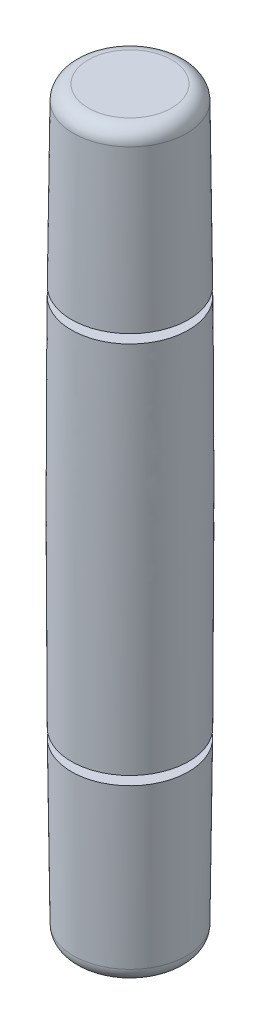
ISO-10303-21;
HEADER;
FILE_DESCRIPTION(('STEP AP214'),'2;1');
FILE_NAME('part.step','',(''),(''),'','','');
FILE_SCHEMA(('AUTOMOTIVE_DESIGN { 1 0 10303 214 1 1 1 1 }'));
ENDSEC;
DATA;
#1=APPLICATION_CONTEXT('core data for automotive mechanical design processes');
#2=APPLICATION_PROTOCOL_DEFINITION('international standard','automotive_design',2000,#1);
#3=PRODUCT_CONTEXT('',#1,'mechanical');
#4=PRODUCT('Part','Part','',(#3));
#5=PRODUCT_RELATED_PRODUCT_CATEGORY('part','',(#4));
#6=PRODUCT_DEFINITION_FORMATION('','',#4);
#7=PRODUCT_DEFINITION_CONTEXT('part definition',#1,'design');
#8=PRODUCT_DEFINITION('design','',#6,#7);
#9=PRODUCT_DEFINITION_SHAPE('','',#8);
#10=(LENGTH_UNIT() NAMED_UNIT(*) SI_UNIT(.MILLI.,.METRE.));
#11=(NAMED_UNIT(*) PLANE_ANGLE_UNIT() SI_UNIT($,.RADIAN.));
#12=(NAMED_UNIT(*) SI_UNIT($,.STERADIAN.) SOLID_ANGLE_UNIT());
#13=UNCERTAINTY_MEASURE_WITH_UNIT(LENGTH_MEASURE(1.E-05),#10,'distance_accuracy_value','');
#14=(GEOMETRIC_REPRESENTATION_CONTEXT(3) GLOBAL_UNCERTAINTY_ASSIGNED_CONTEXT((#13)) GLOBAL_UNIT_ASSIGNED_CONTEXT((#10,
#11,#12)) REPRESENTATION_CONTEXT('',''));
#15=CARTESIAN_POINT('',(0.,0.,0.));
#16=DIRECTION('',(0.,0.,1.));
#17=DIRECTION('',(1.,0.,0.));
#18=AXIS2_PLACEMENT_3D('',#15,#16,#17);
#19=CARTESIAN_POINT('',(1.9,0.,0.));
#20=CARTESIAN_POINT('',(2.1,12.5,0.));
#21=CARTESIAN_POINT('',(1.9,25.,0.));
#22=B_SPLINE_CURVE_WITH_KNOTS('',2,(#19,#20,#21),.UNSPECIFIED.,.F.,.F.,(3,3),(0.,1.),.UNSPECIFIED.);
#23=CARTESIAN_POINT('',(0.,0.,0.));
#24=DIRECTION('',(0.,-1.,0.));
#25=AXIS1_PLACEMENT('',#23,#24);
#26=SURFACE_OF_REVOLUTION('',#22,#25);
#27=CARTESIAN_POINT('',(0.,5.9,0.));
#28=DIRECTION('',(0.,-1.,0.));
#29=DIRECTION('',(0.,0.,-1.));
#30=AXIS2_PLACEMENT_3D('',#27,#28,#29);
#31=CIRCLE('',#30,1.9721216);
#32=CARTESIAN_POINT('',(0.,5.9,-1.9721216));
#33=VERTEX_POINT('',#32);
#34=EDGE_CURVE('E42',#33,#33,#31,.F.);
#35=ORIENTED_EDGE('',*,*,#34,.F.);
#36=EDGE_LOOP('',(#35));
#37=FACE_BOUND('',#36,.T.);
#38=CARTESIAN_POINT('',(0.,0.492315989783819,0.));
#39=DIRECTION('',(0.,-1.,0.));
#40=DIRECTION('',(0.,0.,-1.));
#41=AXIS2_PLACEMENT_3D('',#38,#39,#40);
#42=CIRCLE('',#41,1.90772193581491);
#43=CARTESIAN_POINT('',(0.,0.492315989783819,-1.90772193581491));
#44=VERTEX_POINT('',#43);
#45=EDGE_CURVE('E46',#44,#44,#42,.F.);
#46=ORIENTED_EDGE('',*,*,#45,.T.);
#47=EDGE_LOOP('',(#46));
#48=FACE_BOUND('',#47,.T.);
#49=ADVANCED_FACE('F38',(#37,#48),#26,.F.);
#50=CARTESIAN_POINT('',(0.,0.,0.));
#51=DIRECTION('',(0.,-1.,0.));
#52=DIRECTION('',(0.,0.,-1.));
#53=AXIS2_PLACEMENT_3D('',#50,#51,#52);
#54=PLANE('',#53);
#55=CARTESIAN_POINT('',(0.,0.,0.));
#56=DIRECTION('',(0.,-1.,0.));
#57=DIRECTION('',(0.,0.,-1.));
#58=AXIS2_PLACEMENT_3D('',#55,#56,#57);
#59=CIRCLE('',#58,1.40778098331452);
#60=CARTESIAN_POINT('',(0.,0.,-1.40778098331452));
#61=VERTEX_POINT('',#60);
#62=EDGE_CURVE('E60',#61,#61,#59,.T.);
#63=ORIENTED_EDGE('',*,*,#62,.T.);
#64=EDGE_LOOP('',(#63));
#65=FACE_BOUND('',#64,.T.);
#66=ADVANCED_FACE('F96',(#65),#54,.T.);
#67=CARTESIAN_POINT('',(0.,0.5,0.));
#68=DIRECTION('',(0.,-1.,0.));
#69=DIRECTION('',(0.,0.,-1.));
#70=AXIS2_PLACEMENT_3D('',#67,#68,#69);
#71=TOROIDAL_SURFACE('',#70,1.40778098331452,0.5);
#72=ORIENTED_EDGE('',*,*,#45,.F.);
#73=EDGE_LOOP('',(#72));
#74=FACE_BOUND('',#73,.T.);
#75=ORIENTED_EDGE('',*,*,#62,.F.);
#76=EDGE_LOOP('',(#75));
#77=FACE_BOUND('',#76,.T.);
#78=ADVANCED_FACE('F98',(#74,#77),#71,.T.);
#79=CARTESIAN_POINT('',(0.,0.,0.));
#80=DIRECTION('',(0.,-1.,0.));
#81=DIRECTION('',(0.,0.,-1.));
#82=AXIS2_PLACEMENT_3D('',#79,#80,#81);
#83=CYLINDRICAL_SURFACE('',#82,1.47459948718159);
#84=CARTESIAN_POINT('',(0.,5.9,0.));
#85=DIRECTION('',(0.,-1.,0.));
#86=DIRECTION('',(0.,0.,-1.));
#87=AXIS2_PLACEMENT_3D('',#84,#85,#86);
#88=CIRCLE('',#87,1.4745994871816);
#89=CARTESIAN_POINT('',(0.,5.9,-1.4745994871816));
#90=VERTEX_POINT('',#89);
#91=EDGE_CURVE('E67',#90,#90,#88,.T.);
#92=ORIENTED_EDGE('',*,*,#91,.F.);
#93=EDGE_LOOP('',(#92));
#94=FACE_BOUND('',#93,.T.);
#95=CARTESIAN_POINT('',(0.,6.2,0.));
#96=DIRECTION('',(0.,-1.,0.));
#97=DIRECTION('',(0.,0.,-1.));
#98=AXIS2_PLACEMENT_3D('',#95,#96,#97);
#99=CIRCLE('',#98,1.47459948718159);
#100=CARTESIAN_POINT('',(0.,6.2,-1.47459948718159));
#101=VERTEX_POINT('',#100);
#102=EDGE_CURVE('E56',#101,#101,#99,.T.);
#103=ORIENTED_EDGE('',*,*,#102,.T.);
#104=EDGE_LOOP('',(#103));
#105=FACE_BOUND('',#104,.T.);
#106=ADVANCED_FACE('F101',(#94,#105),#83,.T.);
#107=CARTESIAN_POINT('',(1.97459948718159,6.2,0.));
#108=DIRECTION('',(0.,1.,0.));
#109=DIRECTION('',(0.,0.,1.));
#110=AXIS2_PLACEMENT_3D('',#107,#108,#109);
#111=PLANE('',#110);
#112=ORIENTED_EDGE('',*,*,#102,.F.);
#113=EDGE_LOOP('',(#112));
#114=FACE_BOUND('',#113,.T.);
#115=CARTESIAN_POINT('',(0.,6.2,0.));
#116=DIRECTION('',(0.,-1.,0.));
#117=DIRECTION('',(0.,0.,-1.));
#118=AXIS2_PLACEMENT_3D('',#115,#116,#117);
#119=CIRCLE('',#118,1.97459948718159);
#120=CARTESIAN_POINT('',(0.,6.2,-1.97459948718159));
#121=VERTEX_POINT('',#120);
#122=EDGE_CURVE('E62',#121,#121,#119,.T.);
#123=ORIENTED_EDGE('',*,*,#122,.T.);
#124=EDGE_LOOP('',(#123));
#125=FACE_BOUND('',#124,.T.);
#126=ADVANCED_FACE('F106',(#114,#125),#111,.F.);
#127=CARTESIAN_POINT('',(1.9745994871816,5.9,0.));
#128=DIRECTION('',(0.,-1.,0.));
#129=DIRECTION('',(0.,0.,-1.));
#130=AXIS2_PLACEMENT_3D('',#127,#128,#129);
#131=PLANE('',#130);
#132=ORIENTED_EDGE('',*,*,#34,.T.);
#133=EDGE_LOOP('',(#132));
#134=FACE_BOUND('',#133,.T.);
#135=ORIENTED_EDGE('',*,*,#91,.T.);
#136=EDGE_LOOP('',(#135));
#137=FACE_BOUND('',#136,.T.);
#138=ADVANCED_FACE('F119',(#134,#137),#131,.F.);
#139=ORIENTED_EDGE('',*,*,#122,.F.);
#140=EDGE_LOOP('',(#139));
#141=FACE_BOUND('',#140,.T.);
#142=CARTESIAN_POINT('',(0.,18.8,0.));
#143=DIRECTION('',(0.,-1.,0.));
#144=DIRECTION('',(0.,0.,-1.));
#145=AXIS2_PLACEMENT_3D('',#142,#143,#144);
#146=CIRCLE('',#145,1.97459948718159);
#147=CARTESIAN_POINT('',(0.,18.8,-1.97459948718159));
#148=VERTEX_POINT('',#147);
#149=EDGE_CURVE('E71',#148,#148,#146,.T.);
#150=ORIENTED_EDGE('',*,*,#149,.T.);
#151=EDGE_LOOP('',(#150));
#152=FACE_BOUND('',#151,.T.);
#153=ADVANCED_FACE('F93',(#141,#152),#26,.F.);
#154=CARTESIAN_POINT('',(1.97459948718159,18.8,0.));
#155=DIRECTION('',(0.,-1.,0.));
#156=DIRECTION('',(0.,0.,-1.));
#157=AXIS2_PLACEMENT_3D('',#154,#155,#156);
#158=PLANE('',#157);
#159=ORIENTED_EDGE('',*,*,#149,.F.);
#160=EDGE_LOOP('',(#159));
#161=FACE_BOUND('',#160,.T.);
#162=CARTESIAN_POINT('',(0.,18.8,0.));
#163=DIRECTION('',(0.,-1.,0.));
#164=DIRECTION('',(0.,0.,-1.));
#165=AXIS2_PLACEMENT_3D('',#162,#163,#164);
#166=CIRCLE('',#165,1.47459948718159);
#167=CARTESIAN_POINT('',(0.,18.8,-1.47459948718159));
#168=VERTEX_POINT('',#167);
#169=EDGE_CURVE('E77',#168,#168,#166,.T.);
#170=ORIENTED_EDGE('',*,*,#169,.T.);
#171=EDGE_LOOP('',(#170));
#172=FACE_BOUND('',#171,.T.);
#173=ADVANCED_FACE('F118',(#161,#172),#158,.F.);
#174=CARTESIAN_POINT('',(0.,0.,0.));
#175=DIRECTION('',(0.,-1.,0.));
#176=DIRECTION('',(0.,0.,-1.));
#177=AXIS2_PLACEMENT_3D('',#174,#175,#176);
#178=CYLINDRICAL_SURFACE('',#177,1.47459948718159);
#179=ORIENTED_EDGE('',*,*,#169,.F.);
#180=EDGE_LOOP('',(#179));
#181=FACE_BOUND('',#180,.T.);
#182=CARTESIAN_POINT('',(0.,19.1,0.));
#183=DIRECTION('',(0.,-1.,0.));
#184=DIRECTION('',(0.,0.,-1.));
#185=AXIS2_PLACEMENT_3D('',#182,#183,#184);
#186=CIRCLE('',#185,1.4745994871816);
#187=CARTESIAN_POINT('',(0.,19.1,-1.4745994871816));
#188=VERTEX_POINT('',#187);
#189=EDGE_CURVE('E74',#188,#188,#186,.T.);
#190=ORIENTED_EDGE('',*,*,#189,.T.);
#191=EDGE_LOOP('',(#190));
#192=FACE_BOUND('',#191,.T.);
#193=ADVANCED_FACE('F125',(#181,#192),#178,.T.);
#194=CARTESIAN_POINT('',(1.9745994871816,19.1,0.));
#195=DIRECTION('',(0.,1.,0.));
#196=DIRECTION('',(0.,0.,1.));
#197=AXIS2_PLACEMENT_3D('',#194,#195,#196);
#198=PLANE('',#197);
#199=CARTESIAN_POINT('',(0.,19.1,0.));
#200=DIRECTION('',(0.,-1.,0.));
#201=DIRECTION('',(0.,0.,-1.));
#202=AXIS2_PLACEMENT_3D('',#199,#200,#201);
#203=CIRCLE('',#202,1.9721216);
#204=CARTESIAN_POINT('',(0.,19.1,-1.9721216));
#205=VERTEX_POINT('',#204);
#206=EDGE_CURVE('E54',#205,#205,#203,.T.);
#207=ORIENTED_EDGE('',*,*,#206,.T.);
#208=EDGE_LOOP('',(#207));
#209=FACE_BOUND('',#208,.T.);
#210=ORIENTED_EDGE('',*,*,#189,.F.);
#211=EDGE_LOOP('',(#210));
#212=FACE_BOUND('',#211,.T.);
#213=ADVANCED_FACE('F137',(#209,#212),#198,.F.);
#214=CARTESIAN_POINT('',(0.,25.,0.));
#215=DIRECTION('',(0.,1.,0.));
#216=DIRECTION('',(0.,0.,1.));
#217=AXIS2_PLACEMENT_3D('',#214,#215,#216);
#218=PLANE('',#217);
#219=CARTESIAN_POINT('',(0.,25.,0.));
#220=DIRECTION('',(0.,1.,0.));
#221=DIRECTION('',(0.,0.,1.));
#222=AXIS2_PLACEMENT_3D('',#219,#220,#221);
#223=CIRCLE('',#222,1.40778098331452);
#224=CARTESIAN_POINT('',(0.,25.,1.40778098331452));
#225=VERTEX_POINT('',#224);
#226=EDGE_CURVE('E10',#225,#225,#223,.T.);
#227=ORIENTED_EDGE('',*,*,#226,.T.);
#228=EDGE_LOOP('',(#227));
#229=FACE_BOUND('',#228,.T.);
#230=ADVANCED_FACE('F94',(#229),#218,.T.);
#231=CARTESIAN_POINT('',(0.,24.5,0.));
#232=DIRECTION('',(0.,-1.,0.));
#233=DIRECTION('',(0.,0.,-1.));
#234=AXIS2_PLACEMENT_3D('',#231,#232,#233);
#235=TOROIDAL_SURFACE('',#234,1.40778098331452,0.5);
#236=ORIENTED_EDGE('',*,*,#226,.F.);
#237=EDGE_LOOP('',(#236));
#238=FACE_BOUND('',#237,.T.);
#239=CARTESIAN_POINT('',(0.,24.5076840102162,0.));
#240=DIRECTION('',(0.,-1.,0.));
#241=DIRECTION('',(0.,0.,-1.));
#242=AXIS2_PLACEMENT_3D('',#239,#240,#241);
#243=CIRCLE('',#242,1.90772193581491);
#244=CARTESIAN_POINT('',(0.,24.5076840102162,-1.90772193581491));
#245=VERTEX_POINT('',#244);
#246=EDGE_CURVE('E51',#245,#245,#243,.T.);
#247=ORIENTED_EDGE('',*,*,#246,.F.);
#248=EDGE_LOOP('',(#247));
#249=FACE_BOUND('',#248,.T.);
#250=ADVANCED_FACE('F40',(#238,#249),#235,.T.);
#251=ORIENTED_EDGE('',*,*,#206,.F.);
#252=EDGE_LOOP('',(#251));
#253=FACE_BOUND('',#252,.T.);
#254=ORIENTED_EDGE('',*,*,#246,.T.);
#255=EDGE_LOOP('',(#254));
#256=FACE_BOUND('',#255,.T.);
#257=ADVANCED_FACE('F88',(#253,#256),#26,.F.);
#258=CLOSED_SHELL('',(#49,#66,#78,#106,#126,#138,#153,#173,#193,#213,#230,#250,#257));
#259=MANIFOLD_SOLID_BREP('B2',#258);
#260=ADVANCED_BREP_SHAPE_REPRESENTATION('',(#18,#259),#14);
#261=SHAPE_DEFINITION_REPRESENTATION(#9,#260);
ENDSEC;
END-ISO-10303-21;
